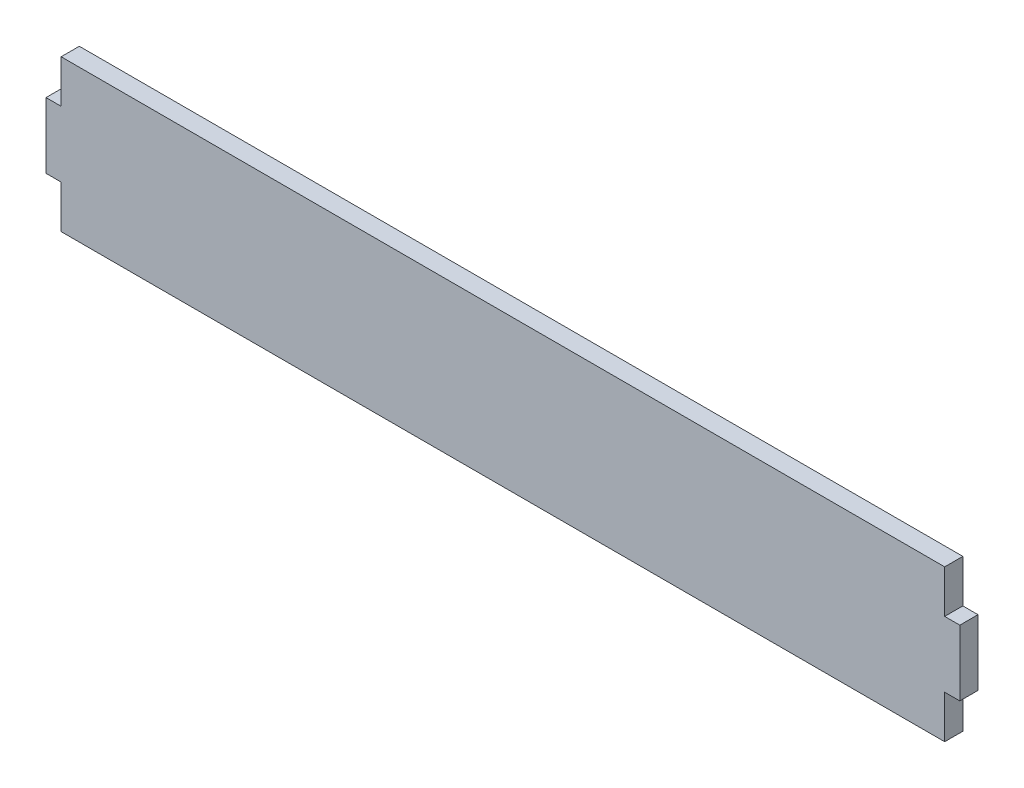
ISO-10303-21;
HEADER;
FILE_DESCRIPTION(('STEP AP214'),'2;1');
FILE_NAME('part.step','',(''),(''),'','','');
FILE_SCHEMA(('AUTOMOTIVE_DESIGN { 1 0 10303 214 1 1 1 1 }'));
ENDSEC;
DATA;
#1=APPLICATION_CONTEXT('core data for automotive mechanical design processes');
#2=APPLICATION_PROTOCOL_DEFINITION('international standard','automotive_design',2000,#1);
#3=PRODUCT_CONTEXT('',#1,'mechanical');
#4=PRODUCT('Part','Part','',(#3));
#5=PRODUCT_RELATED_PRODUCT_CATEGORY('part','',(#4));
#6=PRODUCT_DEFINITION_FORMATION('','',#4);
#7=PRODUCT_DEFINITION_CONTEXT('part definition',#1,'design');
#8=PRODUCT_DEFINITION('design','',#6,#7);
#9=PRODUCT_DEFINITION_SHAPE('','',#8);
#10=(LENGTH_UNIT() NAMED_UNIT(*) SI_UNIT(.MILLI.,.METRE.));
#11=(NAMED_UNIT(*) PLANE_ANGLE_UNIT() SI_UNIT($,.RADIAN.));
#12=(NAMED_UNIT(*) SI_UNIT($,.STERADIAN.) SOLID_ANGLE_UNIT());
#13=UNCERTAINTY_MEASURE_WITH_UNIT(LENGTH_MEASURE(1.E-05),#10,'distance_accuracy_value','');
#14=(GEOMETRIC_REPRESENTATION_CONTEXT(3) GLOBAL_UNCERTAINTY_ASSIGNED_CONTEXT((#13)) GLOBAL_UNIT_ASSIGNED_CONTEXT((#10,
#11,#12)) REPRESENTATION_CONTEXT('',''));
#15=CARTESIAN_POINT('',(0.,0.,0.));
#16=DIRECTION('',(0.,0.,1.));
#17=DIRECTION('',(1.,0.,0.));
#18=AXIS2_PLACEMENT_3D('',#15,#16,#17);
#19=CARTESIAN_POINT('',(0.,21.5,3.6));
#20=DIRECTION('',(1.,0.,0.));
#21=DIRECTION('',(0.,0.,-1.));
#22=AXIS2_PLACEMENT_3D('',#19,#20,#21);
#23=PLANE('',#22);
#24=DIRECTION('',(0.,-1.,0.));
#25=VECTOR('',#24,1.);
#26=CARTESIAN_POINT('',(0.,21.5,0.));
#27=LINE('',#26,#25);
#28=CARTESIAN_POINT('',(0.,21.5,0.));
#29=VERTEX_POINT('',#28);
#30=CARTESIAN_POINT('',(0.,8.49999999999999,0.));
#31=VERTEX_POINT('',#30);
#32=EDGE_CURVE('E153',#29,#31,#27,.T.);
#33=ORIENTED_EDGE('',*,*,#32,.T.);
#34=DIRECTION('',(0.,0.,-1.));
#35=VECTOR('',#34,1.);
#36=CARTESIAN_POINT('',(0.,8.49999999999999,3.6));
#37=LINE('',#36,#35);
#38=CARTESIAN_POINT('',(0.,8.49999999999999,3.6));
#39=VERTEX_POINT('',#38);
#40=EDGE_CURVE('E11',#39,#31,#37,.T.);
#41=ORIENTED_EDGE('',*,*,#40,.F.);
#42=DIRECTION('',(0.,-1.,0.));
#43=VECTOR('',#42,1.);
#44=CARTESIAN_POINT('',(0.,21.5,3.6));
#45=LINE('',#44,#43);
#46=CARTESIAN_POINT('',(0.,21.5,3.6));
#47=VERTEX_POINT('',#46);
#48=EDGE_CURVE('E175',#47,#39,#45,.T.);
#49=ORIENTED_EDGE('',*,*,#48,.F.);
#50=DIRECTION('',(0.,0.,-1.));
#51=VECTOR('',#50,1.);
#52=CARTESIAN_POINT('',(0.,21.5,3.6));
#53=LINE('',#52,#51);
#54=EDGE_CURVE('E149',#47,#29,#53,.T.);
#55=ORIENTED_EDGE('',*,*,#54,.T.);
#56=EDGE_LOOP('',(#33,#41,#49,#55));
#57=FACE_BOUND('',#56,.T.);
#58=ADVANCED_FACE('F33',(#57),#23,.F.);
#59=CARTESIAN_POINT('',(0.,8.49999999999999,3.6));
#60=DIRECTION('',(0.,1.,0.));
#61=DIRECTION('',(0.,0.,1.));
#62=AXIS2_PLACEMENT_3D('',#59,#60,#61);
#63=PLANE('',#62);
#64=DIRECTION('',(1.,0.,0.));
#65=VECTOR('',#64,1.);
#66=CARTESIAN_POINT('',(0.,8.49999999999999,0.));
#67=LINE('',#66,#65);
#68=CARTESIAN_POINT('',(3.00000000000004,8.49999999999999,0.));
#69=VERTEX_POINT('',#68);
#70=EDGE_CURVE('E156',#31,#69,#67,.T.);
#71=ORIENTED_EDGE('',*,*,#70,.T.);
#72=DIRECTION('',(0.,0.,-1.));
#73=VECTOR('',#72,1.);
#74=CARTESIAN_POINT('',(3.00000000000004,8.49999999999999,3.6));
#75=LINE('',#74,#73);
#76=CARTESIAN_POINT('',(3.00000000000004,8.49999999999999,3.6));
#77=VERTEX_POINT('',#76);
#78=EDGE_CURVE('E41',#77,#69,#75,.T.);
#79=ORIENTED_EDGE('',*,*,#78,.F.);
#80=DIRECTION('',(1.,0.,0.));
#81=VECTOR('',#80,1.);
#82=CARTESIAN_POINT('',(0.,8.49999999999999,3.6));
#83=LINE('',#82,#81);
#84=EDGE_CURVE('E104',#39,#77,#83,.T.);
#85=ORIENTED_EDGE('',*,*,#84,.F.);
#86=ORIENTED_EDGE('',*,*,#40,.T.);
#87=EDGE_LOOP('',(#71,#79,#85,#86));
#88=FACE_BOUND('',#87,.T.);
#89=ADVANCED_FACE('F253',(#88),#63,.F.);
#90=CARTESIAN_POINT('',(3.00000000000004,8.49999999999999,3.6));
#91=DIRECTION('',(1.,0.,0.));
#92=DIRECTION('',(0.,1.,0.));
#93=AXIS2_PLACEMENT_3D('',#90,#91,#92);
#94=PLANE('',#93);
#95=DIRECTION('',(0.,-1.,0.));
#96=VECTOR('',#95,1.);
#97=CARTESIAN_POINT('',(3.00000000000004,8.49999999999999,0.));
#98=LINE('',#97,#96);
#99=CARTESIAN_POINT('',(3.00000000000004,0.,0.));
#100=VERTEX_POINT('',#99);
#101=EDGE_CURVE('E158',#69,#100,#98,.T.);
#102=ORIENTED_EDGE('',*,*,#101,.T.);
#103=DIRECTION('',(0.,0.,-1.));
#104=VECTOR('',#103,1.);
#105=CARTESIAN_POINT('',(3.00000000000004,0.,3.6));
#106=LINE('',#105,#104);
#107=CARTESIAN_POINT('',(3.00000000000004,0.,3.6));
#108=VERTEX_POINT('',#107);
#109=EDGE_CURVE('E194',#108,#100,#106,.T.);
#110=ORIENTED_EDGE('',*,*,#109,.F.);
#111=DIRECTION('',(0.,-1.,0.));
#112=VECTOR('',#111,1.);
#113=CARTESIAN_POINT('',(3.00000000000004,8.49999999999999,3.6));
#114=LINE('',#113,#112);
#115=EDGE_CURVE('E202',#77,#108,#114,.T.);
#116=ORIENTED_EDGE('',*,*,#115,.F.);
#117=ORIENTED_EDGE('',*,*,#78,.T.);
#118=EDGE_LOOP('',(#102,#110,#116,#117));
#119=FACE_BOUND('',#118,.T.);
#120=ADVANCED_FACE('F200',(#119),#94,.F.);
#121=CARTESIAN_POINT('',(3.00000000000004,0.,3.6));
#122=DIRECTION('',(0.,1.,0.));
#123=DIRECTION('',(-1.,0.,0.));
#124=AXIS2_PLACEMENT_3D('',#121,#122,#123);
#125=PLANE('',#124);
#126=DIRECTION('',(1.,0.,0.));
#127=VECTOR('',#126,1.);
#128=CARTESIAN_POINT('',(3.00000000000004,0.,0.));
#129=LINE('',#128,#127);
#130=CARTESIAN_POINT('',(177.999999999616,0.,0.));
#131=VERTEX_POINT('',#130);
#132=EDGE_CURVE('E160',#100,#131,#129,.T.);
#133=ORIENTED_EDGE('',*,*,#132,.T.);
#134=DIRECTION('',(0.,0.,-1.));
#135=VECTOR('',#134,1.);
#136=CARTESIAN_POINT('',(177.999999999616,0.,3.6));
#137=LINE('',#136,#135);
#138=CARTESIAN_POINT('',(177.999999999616,0.,3.6));
#139=VERTEX_POINT('',#138);
#140=EDGE_CURVE('E191',#139,#131,#137,.T.);
#141=ORIENTED_EDGE('',*,*,#140,.F.);
#142=DIRECTION('',(1.,0.,0.));
#143=VECTOR('',#142,1.);
#144=CARTESIAN_POINT('',(3.00000000000004,0.,3.6));
#145=LINE('',#144,#143);
#146=EDGE_CURVE('E220',#108,#139,#145,.T.);
#147=ORIENTED_EDGE('',*,*,#146,.F.);
#148=ORIENTED_EDGE('',*,*,#109,.T.);
#149=EDGE_LOOP('',(#133,#141,#147,#148));
#150=FACE_BOUND('',#149,.T.);
#151=ADVANCED_FACE('F211',(#150),#125,.F.);
#152=CARTESIAN_POINT('',(177.999999999616,8.49999999999997,3.6));
#153=DIRECTION('',(-1.,0.,0.));
#154=DIRECTION('',(0.,0.,1.));
#155=AXIS2_PLACEMENT_3D('',#152,#153,#154);
#156=PLANE('',#155);
#157=DIRECTION('',(0.,1.,0.));
#158=VECTOR('',#157,1.);
#159=CARTESIAN_POINT('',(177.999999999616,8.49999999999997,0.));
#160=LINE('',#159,#158);
#161=CARTESIAN_POINT('',(177.999999999616,8.49999999999997,0.));
#162=VERTEX_POINT('',#161);
#163=EDGE_CURVE('E162',#131,#162,#160,.T.);
#164=ORIENTED_EDGE('',*,*,#163,.T.);
#165=DIRECTION('',(0.,0.,-1.));
#166=VECTOR('',#165,1.);
#167=CARTESIAN_POINT('',(177.999999999616,8.49999999999997,3.6));
#168=LINE('',#167,#166);
#169=CARTESIAN_POINT('',(177.999999999616,8.49999999999997,3.6));
#170=VERTEX_POINT('',#169);
#171=EDGE_CURVE('E188',#170,#162,#168,.T.);
#172=ORIENTED_EDGE('',*,*,#171,.F.);
#173=DIRECTION('',(0.,1.,0.));
#174=VECTOR('',#173,1.);
#175=CARTESIAN_POINT('',(177.999999999616,8.49999999999997,3.6));
#176=LINE('',#175,#174);
#177=EDGE_CURVE('E217',#139,#170,#176,.T.);
#178=ORIENTED_EDGE('',*,*,#177,.F.);
#179=ORIENTED_EDGE('',*,*,#140,.T.);
#180=EDGE_LOOP('',(#164,#172,#178,#179));
#181=FACE_BOUND('',#180,.T.);
#182=ADVANCED_FACE('F215',(#181),#156,.F.);
#183=CARTESIAN_POINT('',(180.999999999616,8.49999999999997,3.6));
#184=DIRECTION('',(0.,1.,0.));
#185=DIRECTION('',(0.,0.,1.));
#186=AXIS2_PLACEMENT_3D('',#183,#184,#185);
#187=PLANE('',#186);
#188=DIRECTION('',(1.,0.,0.));
#189=VECTOR('',#188,1.);
#190=CARTESIAN_POINT('',(180.999999999616,8.49999999999997,0.));
#191=LINE('',#190,#189);
#192=CARTESIAN_POINT('',(180.999999999616,8.49999999999997,0.));
#193=VERTEX_POINT('',#192);
#194=EDGE_CURVE('E164',#162,#193,#191,.T.);
#195=ORIENTED_EDGE('',*,*,#194,.T.);
#196=DIRECTION('',(0.,0.,-1.));
#197=VECTOR('',#196,1.);
#198=CARTESIAN_POINT('',(180.999999999616,8.49999999999997,3.6));
#199=LINE('',#198,#197);
#200=CARTESIAN_POINT('',(180.999999999616,8.49999999999997,3.6));
#201=VERTEX_POINT('',#200);
#202=EDGE_CURVE('E185',#201,#193,#199,.T.);
#203=ORIENTED_EDGE('',*,*,#202,.F.);
#204=DIRECTION('',(1.,0.,0.));
#205=VECTOR('',#204,1.);
#206=CARTESIAN_POINT('',(180.999999999616,8.49999999999997,3.6));
#207=LINE('',#206,#205);
#208=EDGE_CURVE('E219',#170,#201,#207,.T.);
#209=ORIENTED_EDGE('',*,*,#208,.F.);
#210=ORIENTED_EDGE('',*,*,#171,.T.);
#211=EDGE_LOOP('',(#195,#203,#209,#210));
#212=FACE_BOUND('',#211,.T.);
#213=ADVANCED_FACE('F266',(#212),#187,.F.);
#214=CARTESIAN_POINT('',(180.999999999616,21.5,3.6));
#215=DIRECTION('',(-1.,0.,0.));
#216=DIRECTION('',(0.,0.,1.));
#217=AXIS2_PLACEMENT_3D('',#214,#215,#216);
#218=PLANE('',#217);
#219=DIRECTION('',(0.,1.,0.));
#220=VECTOR('',#219,1.);
#221=CARTESIAN_POINT('',(180.999999999616,21.5,0.));
#222=LINE('',#221,#220);
#223=CARTESIAN_POINT('',(180.999999999616,21.5,0.));
#224=VERTEX_POINT('',#223);
#225=EDGE_CURVE('E166',#193,#224,#222,.T.);
#226=ORIENTED_EDGE('',*,*,#225,.T.);
#227=DIRECTION('',(0.,0.,-1.));
#228=VECTOR('',#227,1.);
#229=CARTESIAN_POINT('',(180.999999999616,21.5,3.6));
#230=LINE('',#229,#228);
#231=CARTESIAN_POINT('',(180.999999999616,21.5,3.6));
#232=VERTEX_POINT('',#231);
#233=EDGE_CURVE('E182',#232,#224,#230,.T.);
#234=ORIENTED_EDGE('',*,*,#233,.F.);
#235=DIRECTION('',(0.,1.,0.));
#236=VECTOR('',#235,1.);
#237=CARTESIAN_POINT('',(180.999999999616,21.5,3.6));
#238=LINE('',#237,#236);
#239=EDGE_CURVE('E222',#201,#232,#238,.T.);
#240=ORIENTED_EDGE('',*,*,#239,.F.);
#241=ORIENTED_EDGE('',*,*,#202,.T.);
#242=EDGE_LOOP('',(#226,#234,#240,#241));
#243=FACE_BOUND('',#242,.T.);
#244=ADVANCED_FACE('F269',(#243),#218,.F.);
#245=CARTESIAN_POINT('',(180.999999999616,21.5,3.6));
#246=DIRECTION('',(0.,-1.,0.));
#247=DIRECTION('',(0.,0.,-1.));
#248=AXIS2_PLACEMENT_3D('',#245,#246,#247);
#249=PLANE('',#248);
#250=DIRECTION('',(-1.,0.,0.));
#251=VECTOR('',#250,1.);
#252=CARTESIAN_POINT('',(180.999999999616,21.5,0.));
#253=LINE('',#252,#251);
#254=CARTESIAN_POINT('',(177.999999999616,21.5,0.));
#255=VERTEX_POINT('',#254);
#256=EDGE_CURVE('E168',#224,#255,#253,.T.);
#257=ORIENTED_EDGE('',*,*,#256,.T.);
#258=DIRECTION('',(0.,0.,-1.));
#259=VECTOR('',#258,1.);
#260=CARTESIAN_POINT('',(177.999999999616,21.5,3.6));
#261=LINE('',#260,#259);
#262=CARTESIAN_POINT('',(177.999999999616,21.5,3.6));
#263=VERTEX_POINT('',#262);
#264=EDGE_CURVE('E179',#263,#255,#261,.T.);
#265=ORIENTED_EDGE('',*,*,#264,.F.);
#266=DIRECTION('',(-1.,0.,0.));
#267=VECTOR('',#266,1.);
#268=CARTESIAN_POINT('',(180.999999999616,21.5,3.6));
#269=LINE('',#268,#267);
#270=EDGE_CURVE('E228',#232,#263,#269,.T.);
#271=ORIENTED_EDGE('',*,*,#270,.F.);
#272=ORIENTED_EDGE('',*,*,#233,.T.);
#273=EDGE_LOOP('',(#257,#265,#271,#272));
#274=FACE_BOUND('',#273,.T.);
#275=ADVANCED_FACE('F234',(#274),#249,.F.);
#276=CARTESIAN_POINT('',(177.999999999616,21.5,3.6));
#277=DIRECTION('',(-1.,0.,0.));
#278=DIRECTION('',(0.,0.,1.));
#279=AXIS2_PLACEMENT_3D('',#276,#277,#278);
#280=PLANE('',#279);
#281=DIRECTION('',(0.,1.,0.));
#282=VECTOR('',#281,1.);
#283=CARTESIAN_POINT('',(177.999999999616,21.5,0.));
#284=LINE('',#283,#282);
#285=CARTESIAN_POINT('',(177.999999999616,30.,0.));
#286=VERTEX_POINT('',#285);
#287=EDGE_CURVE('E170',#255,#286,#284,.T.);
#288=ORIENTED_EDGE('',*,*,#287,.T.);
#289=DIRECTION('',(0.,0.,-1.));
#290=VECTOR('',#289,1.);
#291=CARTESIAN_POINT('',(177.999999999616,30.,3.6));
#292=LINE('',#291,#290);
#293=CARTESIAN_POINT('',(177.999999999616,30.,3.6));
#294=VERTEX_POINT('',#293);
#295=EDGE_CURVE('E144',#294,#286,#292,.T.);
#296=ORIENTED_EDGE('',*,*,#295,.F.);
#297=DIRECTION('',(0.,1.,0.));
#298=VECTOR('',#297,1.);
#299=CARTESIAN_POINT('',(177.999999999616,21.5,3.6));
#300=LINE('',#299,#298);
#301=EDGE_CURVE('E135',#263,#294,#300,.T.);
#302=ORIENTED_EDGE('',*,*,#301,.F.);
#303=ORIENTED_EDGE('',*,*,#264,.T.);
#304=EDGE_LOOP('',(#288,#296,#302,#303));
#305=FACE_BOUND('',#304,.T.);
#306=ADVANCED_FACE('F238',(#305),#280,.F.);
#307=CARTESIAN_POINT('',(3.00000000000004,30.,3.6));
#308=DIRECTION('',(0.,-1.,0.));
#309=DIRECTION('',(1.,0.,0.));
#310=AXIS2_PLACEMENT_3D('',#307,#308,#309);
#311=PLANE('',#310);
#312=DIRECTION('',(-1.,0.,0.));
#313=VECTOR('',#312,1.);
#314=CARTESIAN_POINT('',(3.00000000000004,30.,0.));
#315=LINE('',#314,#313);
#316=CARTESIAN_POINT('',(3.00000000000004,30.,0.));
#317=VERTEX_POINT('',#316);
#318=EDGE_CURVE('E143',#286,#317,#315,.T.);
#319=ORIENTED_EDGE('',*,*,#318,.T.);
#320=DIRECTION('',(0.,0.,-1.));
#321=VECTOR('',#320,1.);
#322=CARTESIAN_POINT('',(3.00000000000004,30.,3.6));
#323=LINE('',#322,#321);
#324=CARTESIAN_POINT('',(3.00000000000004,30.,3.6));
#325=VERTEX_POINT('',#324);
#326=EDGE_CURVE('E140',#325,#317,#323,.T.);
#327=ORIENTED_EDGE('',*,*,#326,.F.);
#328=DIRECTION('',(-1.,0.,0.));
#329=VECTOR('',#328,1.);
#330=CARTESIAN_POINT('',(3.00000000000004,30.,3.6));
#331=LINE('',#330,#329);
#332=EDGE_CURVE('E129',#294,#325,#331,.T.);
#333=ORIENTED_EDGE('',*,*,#332,.F.);
#334=ORIENTED_EDGE('',*,*,#295,.T.);
#335=EDGE_LOOP('',(#319,#327,#333,#334));
#336=FACE_BOUND('',#335,.T.);
#337=ADVANCED_FACE('F141',(#336),#311,.F.);
#338=CARTESIAN_POINT('',(3.00000000000004,21.5,3.6));
#339=DIRECTION('',(1.,0.,0.));
#340=DIRECTION('',(0.,1.,0.));
#341=AXIS2_PLACEMENT_3D('',#338,#339,#340);
#342=PLANE('',#341);
#343=DIRECTION('',(0.,-1.,0.));
#344=VECTOR('',#343,1.);
#345=CARTESIAN_POINT('',(3.00000000000004,21.5,0.));
#346=LINE('',#345,#344);
#347=CARTESIAN_POINT('',(3.00000000000004,21.5,0.));
#348=VERTEX_POINT('',#347);
#349=EDGE_CURVE('E90',#317,#348,#346,.T.);
#350=ORIENTED_EDGE('',*,*,#349,.T.);
#351=DIRECTION('',(0.,0.,-1.));
#352=VECTOR('',#351,1.);
#353=CARTESIAN_POINT('',(3.00000000000004,21.5,3.6));
#354=LINE('',#353,#352);
#355=CARTESIAN_POINT('',(3.00000000000004,21.5,3.6));
#356=VERTEX_POINT('',#355);
#357=EDGE_CURVE('E145',#356,#348,#354,.T.);
#358=ORIENTED_EDGE('',*,*,#357,.F.);
#359=DIRECTION('',(0.,-1.,0.));
#360=VECTOR('',#359,1.);
#361=CARTESIAN_POINT('',(3.00000000000004,21.5,3.6));
#362=LINE('',#361,#360);
#363=EDGE_CURVE('E133',#325,#356,#362,.T.);
#364=ORIENTED_EDGE('',*,*,#363,.F.);
#365=ORIENTED_EDGE('',*,*,#326,.T.);
#366=EDGE_LOOP('',(#350,#358,#364,#365));
#367=FACE_BOUND('',#366,.T.);
#368=ADVANCED_FACE('F147',(#367),#342,.F.);
#369=CARTESIAN_POINT('',(0.,21.5,3.6));
#370=DIRECTION('',(0.,-1.,0.));
#371=DIRECTION('',(0.,0.,-1.));
#372=AXIS2_PLACEMENT_3D('',#369,#370,#371);
#373=PLANE('',#372);
#374=DIRECTION('',(-1.,0.,0.));
#375=VECTOR('',#374,1.);
#376=CARTESIAN_POINT('',(0.,21.5,0.));
#377=LINE('',#376,#375);
#378=EDGE_CURVE('E96',#348,#29,#377,.T.);
#379=ORIENTED_EDGE('',*,*,#378,.T.);
#380=ORIENTED_EDGE('',*,*,#54,.F.);
#381=DIRECTION('',(-1.,0.,0.));
#382=VECTOR('',#381,1.);
#383=CARTESIAN_POINT('',(0.,21.5,3.6));
#384=LINE('',#383,#382);
#385=EDGE_CURVE('E49',#356,#47,#384,.T.);
#386=ORIENTED_EDGE('',*,*,#385,.F.);
#387=ORIENTED_EDGE('',*,*,#357,.T.);
#388=EDGE_LOOP('',(#379,#380,#386,#387));
#389=FACE_BOUND('',#388,.T.);
#390=ADVANCED_FACE('F242',(#389),#373,.F.);
#391=CARTESIAN_POINT('',(0.,0.,3.6));
#392=DIRECTION('',(0.,0.,1.));
#393=DIRECTION('',(1.,0.,0.));
#394=AXIS2_PLACEMENT_3D('',#391,#392,#393);
#395=PLANE('',#394);
#396=ORIENTED_EDGE('',*,*,#48,.T.);
#397=ORIENTED_EDGE('',*,*,#84,.T.);
#398=ORIENTED_EDGE('',*,*,#115,.T.);
#399=ORIENTED_EDGE('',*,*,#146,.T.);
#400=ORIENTED_EDGE('',*,*,#177,.T.);
#401=ORIENTED_EDGE('',*,*,#208,.T.);
#402=ORIENTED_EDGE('',*,*,#239,.T.);
#403=ORIENTED_EDGE('',*,*,#270,.T.);
#404=ORIENTED_EDGE('',*,*,#301,.T.);
#405=ORIENTED_EDGE('',*,*,#332,.T.);
#406=ORIENTED_EDGE('',*,*,#363,.T.);
#407=ORIENTED_EDGE('',*,*,#385,.T.);
#408=EDGE_LOOP('',(#396,#397,#398,#399,#400,#401,#402,#403,#404,#405,#406,#407));
#409=FACE_BOUND('',#408,.T.);
#410=ADVANCED_FACE('F131',(#409),#395,.T.);
#411=CARTESIAN_POINT('',(0.,0.,0.));
#412=DIRECTION('',(0.,0.,1.));
#413=DIRECTION('',(1.,0.,0.));
#414=AXIS2_PLACEMENT_3D('',#411,#412,#413);
#415=PLANE('',#414);
#416=ORIENTED_EDGE('',*,*,#32,.F.);
#417=ORIENTED_EDGE('',*,*,#378,.F.);
#418=ORIENTED_EDGE('',*,*,#349,.F.);
#419=ORIENTED_EDGE('',*,*,#318,.F.);
#420=ORIENTED_EDGE('',*,*,#287,.F.);
#421=ORIENTED_EDGE('',*,*,#256,.F.);
#422=ORIENTED_EDGE('',*,*,#225,.F.);
#423=ORIENTED_EDGE('',*,*,#194,.F.);
#424=ORIENTED_EDGE('',*,*,#163,.F.);
#425=ORIENTED_EDGE('',*,*,#132,.F.);
#426=ORIENTED_EDGE('',*,*,#101,.F.);
#427=ORIENTED_EDGE('',*,*,#70,.F.);
#428=EDGE_LOOP('',(#416,#417,#418,#419,#420,#421,#422,#423,#424,#425,#426,#427));
#429=FACE_BOUND('',#428,.T.);
#430=ADVANCED_FACE('F206',(#429),#415,.F.);
#431=CLOSED_SHELL('',(#58,#89,#120,#151,#182,#213,#244,#275,#306,#337,#368,#390,#410,#430));
#432=MANIFOLD_SOLID_BREP('B2',#431);
#433=ADVANCED_BREP_SHAPE_REPRESENTATION('',(#18,#432),#14);
#434=SHAPE_DEFINITION_REPRESENTATION(#9,#433);
ENDSEC;
END-ISO-10303-21;
